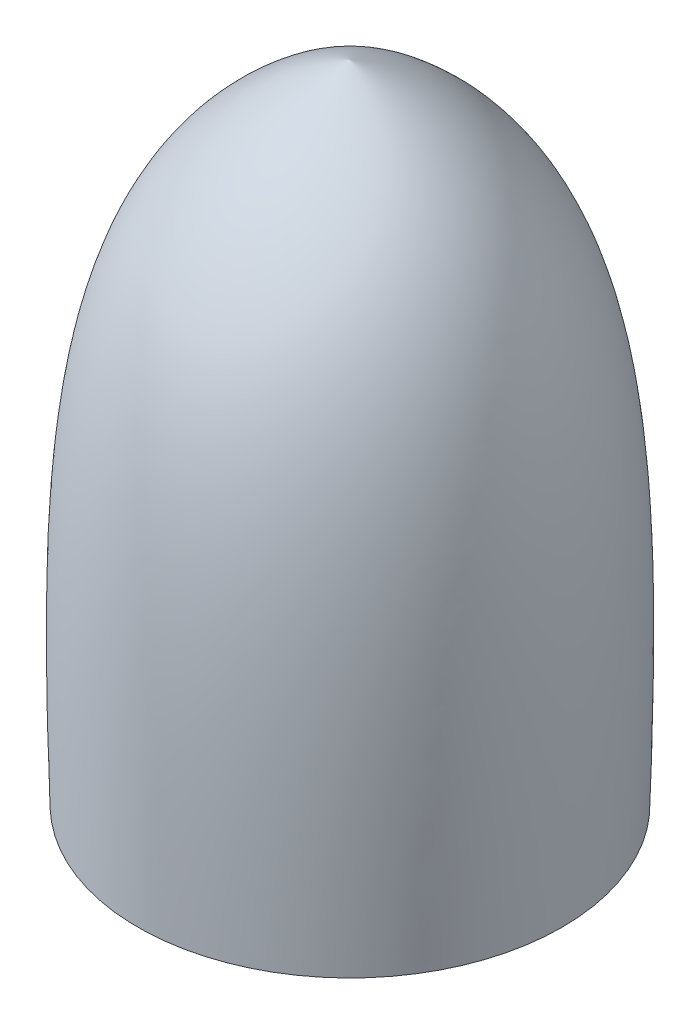
ISO-10303-21;
HEADER;
FILE_DESCRIPTION(('STEP AP214'),'2;1');
FILE_NAME('part.step','',(''),(''),'','','');
FILE_SCHEMA(('AUTOMOTIVE_DESIGN { 1 0 10303 214 1 1 1 1 }'));
ENDSEC;
DATA;
#1=APPLICATION_CONTEXT('core data for automotive mechanical design processes');
#2=APPLICATION_PROTOCOL_DEFINITION('international standard','automotive_design',2000,#1);
#3=PRODUCT_CONTEXT('',#1,'mechanical');
#4=PRODUCT('Part','Part','',(#3));
#5=PRODUCT_RELATED_PRODUCT_CATEGORY('part','',(#4));
#6=PRODUCT_DEFINITION_FORMATION('','',#4);
#7=PRODUCT_DEFINITION_CONTEXT('part definition',#1,'design');
#8=PRODUCT_DEFINITION('design','',#6,#7);
#9=PRODUCT_DEFINITION_SHAPE('','',#8);
#10=(LENGTH_UNIT() NAMED_UNIT(*) SI_UNIT(.MILLI.,.METRE.));
#11=(NAMED_UNIT(*) PLANE_ANGLE_UNIT() SI_UNIT($,.RADIAN.));
#12=(NAMED_UNIT(*) SI_UNIT($,.STERADIAN.) SOLID_ANGLE_UNIT());
#13=UNCERTAINTY_MEASURE_WITH_UNIT(LENGTH_MEASURE(1.E-05),#10,'distance_accuracy_value','');
#14=(GEOMETRIC_REPRESENTATION_CONTEXT(3) GLOBAL_UNCERTAINTY_ASSIGNED_CONTEXT((#13)) GLOBAL_UNIT_ASSIGNED_CONTEXT((#10,
#11,#12)) REPRESENTATION_CONTEXT('',''));
#15=CARTESIAN_POINT('',(0.,0.,0.));
#16=DIRECTION('',(0.,0.,1.));
#17=DIRECTION('',(1.,0.,0.));
#18=AXIS2_PLACEMENT_3D('',#15,#16,#17);
#19=CARTESIAN_POINT('',(2.30129840200414,-3.30400876547769,0.));
#20=CARTESIAN_POINT('',(2.41046027144387,0.516656664912789,0.));
#21=CARTESIAN_POINT('',(2.31841510847184,2.75823016193829,0.));
#22=CARTESIAN_POINT('',(0.,3.69599123452232,0.));
#23=B_SPLINE_CURVE_WITH_KNOTS('',3,(#19,#20,#21,#22),.UNSPECIFIED.,.F.,.F.,(4,4),(0.,1.),.UNSPECIFIED.);
#24=CARTESIAN_POINT('',(0.,3.69599123452232,0.));
#25=DIRECTION('',(0.,1.,0.));
#26=AXIS1_PLACEMENT('',#24,#25);
#27=SURFACE_OF_REVOLUTION('',#23,#26);
#28=CARTESIAN_POINT('',(0.,3.69599123452232,0.));
#29=VERTEX_POINT('',#28);
#30=VERTEX_LOOP('',#29);
#31=FACE_BOUND('',#30,.T.);
#32=CARTESIAN_POINT('',(0.,-3.30400876547768,0.));
#33=DIRECTION('',(0.,1.,0.));
#34=DIRECTION('',(-1.,0.,0.));
#35=AXIS2_PLACEMENT_3D('',#32,#33,#34);
#36=CIRCLE('',#35,2.30129840200414);
#37=CARTESIAN_POINT('',(-2.30129840200414,-3.30400876547768,0.));
#38=VERTEX_POINT('',#37);
#39=EDGE_CURVE('E55',#38,#38,#36,.T.);
#40=ORIENTED_EDGE('',*,*,#39,.T.);
#41=EDGE_LOOP('',(#40));
#42=FACE_BOUND('',#41,.T.);
#43=ADVANCED_FACE('F40',(#31,#42),#27,.T.);
#44=CARTESIAN_POINT('',(1.2,2.69599123452232,0.));
#45=DIRECTION('',(0.,1.,0.));
#46=DIRECTION('',(-1.,0.,0.));
#47=AXIS2_PLACEMENT_3D('',#44,#45,#46);
#48=PLANE('',#47);
#49=CARTESIAN_POINT('',(0.,2.69599123452232,0.));
#50=DIRECTION('',(0.,1.,0.));
#51=DIRECTION('',(-1.,0.,0.));
#52=AXIS2_PLACEMENT_3D('',#49,#50,#51);
#53=CIRCLE('',#52,1.2);
#54=CARTESIAN_POINT('',(-1.2,2.69599123452232,0.));
#55=VERTEX_POINT('',#54);
#56=EDGE_CURVE('E11',#55,#55,#53,.T.);
#57=ORIENTED_EDGE('',*,*,#56,.F.);
#58=EDGE_LOOP('',(#57));
#59=FACE_BOUND('',#58,.T.);
#60=ADVANCED_FACE('F52',(#59),#48,.F.);
#61=CARTESIAN_POINT('',(0.,3.69599123452232,0.));
#62=DIRECTION('',(0.,1.,0.));
#63=DIRECTION('',(-1.,0.,0.));
#64=AXIS2_PLACEMENT_3D('',#61,#62,#63);
#65=CYLINDRICAL_SURFACE('',#64,1.2);
#66=CARTESIAN_POINT('',(0.,-3.30400876547768,0.));
#67=DIRECTION('',(0.,1.,0.));
#68=DIRECTION('',(-1.,0.,0.));
#69=AXIS2_PLACEMENT_3D('',#66,#67,#68);
#70=CIRCLE('',#69,1.2);
#71=CARTESIAN_POINT('',(-1.2,-3.30400876547768,0.));
#72=VERTEX_POINT('',#71);
#73=EDGE_CURVE('E47',#72,#72,#70,.T.);
#74=ORIENTED_EDGE('',*,*,#73,.F.);
#75=EDGE_LOOP('',(#74));
#76=FACE_BOUND('',#75,.T.);
#77=ORIENTED_EDGE('',*,*,#56,.T.);
#78=EDGE_LOOP('',(#77));
#79=FACE_BOUND('',#78,.T.);
#80=ADVANCED_FACE('F69',(#76,#79),#65,.F.);
#81=CARTESIAN_POINT('',(1.2,-3.30400876547768,0.));
#82=DIRECTION('',(0.,1.,0.));
#83=DIRECTION('',(-1.,0.,0.));
#84=AXIS2_PLACEMENT_3D('',#81,#82,#83);
#85=PLANE('',#84);
#86=ORIENTED_EDGE('',*,*,#39,.F.);
#87=EDGE_LOOP('',(#86));
#88=FACE_BOUND('',#87,.T.);
#89=ORIENTED_EDGE('',*,*,#73,.T.);
#90=EDGE_LOOP('',(#89));
#91=FACE_BOUND('',#90,.T.);
#92=ADVANCED_FACE('F67',(#88,#91),#85,.F.);
#93=CLOSED_SHELL('',(#43,#60,#80,#92));
#94=MANIFOLD_SOLID_BREP('B2',#93);
#95=ADVANCED_BREP_SHAPE_REPRESENTATION('',(#18,#94),#14);
#96=SHAPE_DEFINITION_REPRESENTATION(#9,#95);
ENDSEC;
END-ISO-10303-21;
